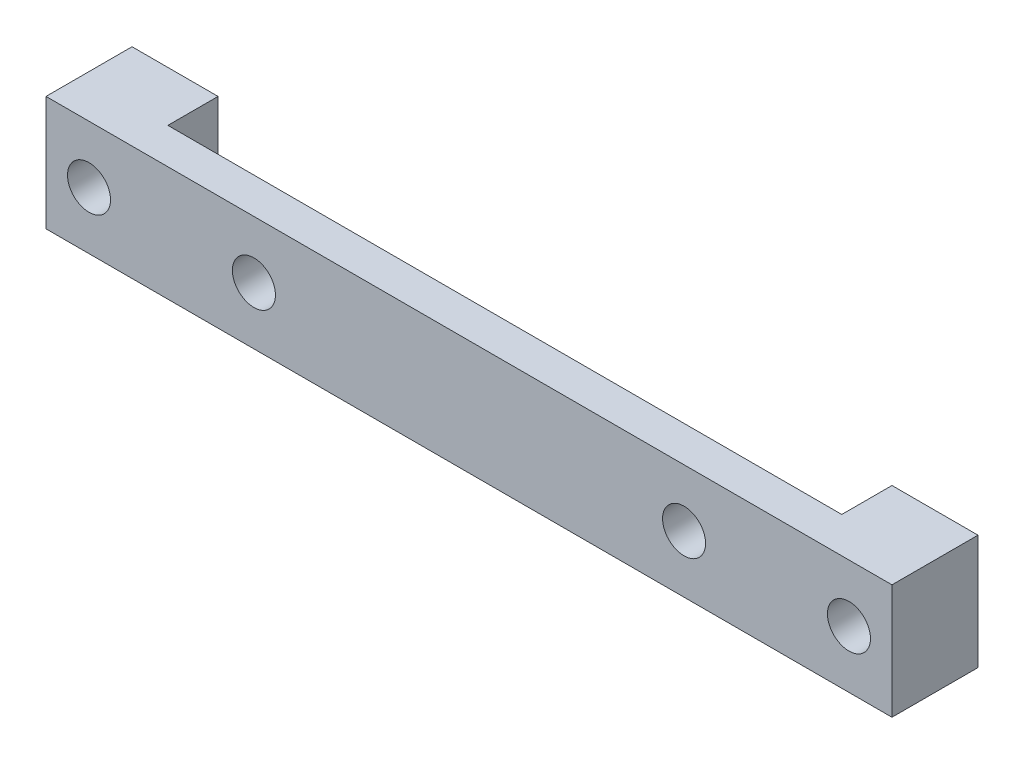
ISO-10303-21;
HEADER;
FILE_DESCRIPTION(('STEP AP214'),'2;1');
FILE_NAME('part.step','',(''),(''),'','','');
FILE_SCHEMA(('AUTOMOTIVE_DESIGN { 1 0 10303 214 1 1 1 1 }'));
ENDSEC;
DATA;
#1=APPLICATION_CONTEXT('core data for automotive mechanical design processes');
#2=APPLICATION_PROTOCOL_DEFINITION('international standard','automotive_design',2000,#1);
#3=PRODUCT_CONTEXT('',#1,'mechanical');
#4=PRODUCT('Part','Part','',(#3));
#5=PRODUCT_RELATED_PRODUCT_CATEGORY('part','',(#4));
#6=PRODUCT_DEFINITION_FORMATION('','',#4);
#7=PRODUCT_DEFINITION_CONTEXT('part definition',#1,'design');
#8=PRODUCT_DEFINITION('design','',#6,#7);
#9=PRODUCT_DEFINITION_SHAPE('','',#8);
#10=(LENGTH_UNIT() NAMED_UNIT(*) SI_UNIT(.MILLI.,.METRE.));
#11=(NAMED_UNIT(*) PLANE_ANGLE_UNIT() SI_UNIT($,.RADIAN.));
#12=(NAMED_UNIT(*) SI_UNIT($,.STERADIAN.) SOLID_ANGLE_UNIT());
#13=UNCERTAINTY_MEASURE_WITH_UNIT(LENGTH_MEASURE(1.E-05),#10,'distance_accuracy_value','');
#14=(GEOMETRIC_REPRESENTATION_CONTEXT(3) GLOBAL_UNCERTAINTY_ASSIGNED_CONTEXT((#13)) GLOBAL_UNIT_ASSIGNED_CONTEXT((#10,
#11,#12)) REPRESENTATION_CONTEXT('',''));
#15=CARTESIAN_POINT('',(0.,0.,0.));
#16=DIRECTION('',(0.,0.,1.));
#17=DIRECTION('',(1.,0.,0.));
#18=AXIS2_PLACEMENT_3D('',#15,#16,#17);
#19=CARTESIAN_POINT('',(29.5,-4.,0.));
#20=DIRECTION('',(0.,0.,1.));
#21=DIRECTION('',(1.,0.,0.));
#22=AXIS2_PLACEMENT_3D('',#19,#20,#21);
#23=PLANE('',#22);
#24=CARTESIAN_POINT('',(26.5,0.,0.));
#25=DIRECTION('',(0.,0.,1.));
#26=DIRECTION('',(1.,0.,0.));
#27=AXIS2_PLACEMENT_3D('',#24,#25,#26);
#28=CIRCLE('',#27,1.5);
#29=CARTESIAN_POINT('',(28.,0.,0.));
#30=VERTEX_POINT('',#29);
#31=EDGE_CURVE('E137',#30,#30,#28,.T.);
#32=ORIENTED_EDGE('',*,*,#31,.T.);
#33=EDGE_LOOP('',(#32));
#34=FACE_BOUND('',#33,.T.);
#35=DIRECTION('',(1.,0.,0.));
#36=VECTOR('',#35,1.);
#37=CARTESIAN_POINT('',(-29.5,-4.,0.));
#38=LINE('',#37,#36);
#39=CARTESIAN_POINT('',(23.5,-4.,0.));
#40=VERTEX_POINT('',#39);
#41=CARTESIAN_POINT('',(29.5,-4.,0.));
#42=VERTEX_POINT('',#41);
#43=EDGE_CURVE('E75',#40,#42,#38,.T.);
#44=ORIENTED_EDGE('',*,*,#43,.F.);
#45=DIRECTION('',(0.,1.,0.));
#46=VECTOR('',#45,1.);
#47=CARTESIAN_POINT('',(23.5,-4.,0.));
#48=LINE('',#47,#46);
#49=CARTESIAN_POINT('',(23.5,4.,0.));
#50=VERTEX_POINT('',#49);
#51=EDGE_CURVE('E134',#40,#50,#48,.T.);
#52=ORIENTED_EDGE('',*,*,#51,.T.);
#53=DIRECTION('',(-1.,0.,0.));
#54=VECTOR('',#53,1.);
#55=CARTESIAN_POINT('',(-29.5,4.,0.));
#56=LINE('',#55,#54);
#57=CARTESIAN_POINT('',(29.5,4.,0.));
#58=VERTEX_POINT('',#57);
#59=EDGE_CURVE('E167',#58,#50,#56,.T.);
#60=ORIENTED_EDGE('',*,*,#59,.F.);
#61=DIRECTION('',(0.,1.,0.));
#62=VECTOR('',#61,1.);
#63=CARTESIAN_POINT('',(29.5,4.,0.));
#64=LINE('',#63,#62);
#65=EDGE_CURVE('E153',#42,#58,#64,.T.);
#66=ORIENTED_EDGE('',*,*,#65,.F.);
#67=EDGE_LOOP('',(#44,#52,#60,#66));
#68=FACE_BOUND('',#67,.T.);
#69=ADVANCED_FACE('F31',(#34,#68),#23,.F.);
#70=CARTESIAN_POINT('',(29.5,-4.,6.));
#71=DIRECTION('',(0.,0.,1.));
#72=DIRECTION('',(1.,0.,0.));
#73=AXIS2_PLACEMENT_3D('',#70,#71,#72);
#74=PLANE('',#73);
#75=CARTESIAN_POINT('',(15.,0.,6.));
#76=DIRECTION('',(0.,0.,1.));
#77=DIRECTION('',(1.,0.,0.));
#78=AXIS2_PLACEMENT_3D('',#75,#76,#77);
#79=CIRCLE('',#78,1.5);
#80=CARTESIAN_POINT('',(16.5,0.,6.));
#81=VERTEX_POINT('',#80);
#82=EDGE_CURVE('E141',#81,#81,#79,.T.);
#83=ORIENTED_EDGE('',*,*,#82,.F.);
#84=EDGE_LOOP('',(#83));
#85=FACE_BOUND('',#84,.T.);
#86=CARTESIAN_POINT('',(-26.5,0.,6.));
#87=DIRECTION('',(0.,0.,1.));
#88=DIRECTION('',(1.,0.,0.));
#89=AXIS2_PLACEMENT_3D('',#86,#87,#88);
#90=CIRCLE('',#89,1.5);
#91=CARTESIAN_POINT('',(-25.,0.,6.));
#92=VERTEX_POINT('',#91);
#93=EDGE_CURVE('E150',#92,#92,#90,.T.);
#94=ORIENTED_EDGE('',*,*,#93,.F.);
#95=EDGE_LOOP('',(#94));
#96=FACE_BOUND('',#95,.T.);
#97=DIRECTION('',(0.,1.,0.));
#98=VECTOR('',#97,1.);
#99=CARTESIAN_POINT('',(29.5,4.,6.));
#100=LINE('',#99,#98);
#101=CARTESIAN_POINT('',(29.5,-4.,6.));
#102=VERTEX_POINT('',#101);
#103=CARTESIAN_POINT('',(29.5,4.,6.));
#104=VERTEX_POINT('',#103);
#105=EDGE_CURVE('E156',#102,#104,#100,.T.);
#106=ORIENTED_EDGE('',*,*,#105,.T.);
#107=DIRECTION('',(-1.,0.,0.));
#108=VECTOR('',#107,1.);
#109=CARTESIAN_POINT('',(-29.5,4.,6.));
#110=LINE('',#109,#108);
#111=CARTESIAN_POINT('',(-29.5,4.,6.));
#112=VERTEX_POINT('',#111);
#113=EDGE_CURVE('E83',#104,#112,#110,.T.);
#114=ORIENTED_EDGE('',*,*,#113,.T.);
#115=DIRECTION('',(0.,-1.,0.));
#116=VECTOR('',#115,1.);
#117=CARTESIAN_POINT('',(-29.5,4.,6.));
#118=LINE('',#117,#116);
#119=CARTESIAN_POINT('',(-29.5,-4.,6.));
#120=VERTEX_POINT('',#119);
#121=EDGE_CURVE('E160',#112,#120,#118,.T.);
#122=ORIENTED_EDGE('',*,*,#121,.T.);
#123=DIRECTION('',(1.,0.,0.));
#124=VECTOR('',#123,1.);
#125=CARTESIAN_POINT('',(-29.5,-4.,6.));
#126=LINE('',#125,#124);
#127=EDGE_CURVE('E55',#120,#102,#126,.T.);
#128=ORIENTED_EDGE('',*,*,#127,.T.);
#129=EDGE_LOOP('',(#106,#114,#122,#128));
#130=FACE_BOUND('',#129,.T.);
#131=CARTESIAN_POINT('',(-15.,0.,6.));
#132=DIRECTION('',(0.,0.,1.));
#133=DIRECTION('',(1.,0.,0.));
#134=AXIS2_PLACEMENT_3D('',#131,#132,#133);
#135=CIRCLE('',#134,1.5);
#136=CARTESIAN_POINT('',(-13.5,0.,6.));
#137=VERTEX_POINT('',#136);
#138=EDGE_CURVE('E146',#137,#137,#135,.T.);
#139=ORIENTED_EDGE('',*,*,#138,.F.);
#140=EDGE_LOOP('',(#139));
#141=FACE_BOUND('',#140,.T.);
#142=CARTESIAN_POINT('',(26.5,0.,6.));
#143=DIRECTION('',(0.,0.,1.));
#144=DIRECTION('',(1.,0.,0.));
#145=AXIS2_PLACEMENT_3D('',#142,#143,#144);
#146=CIRCLE('',#145,1.5);
#147=CARTESIAN_POINT('',(28.,0.,6.));
#148=VERTEX_POINT('',#147);
#149=EDGE_CURVE('E138',#148,#148,#146,.T.);
#150=ORIENTED_EDGE('',*,*,#149,.F.);
#151=EDGE_LOOP('',(#150));
#152=FACE_BOUND('',#151,.T.);
#153=ADVANCED_FACE('F192',(#85,#96,#130,#141,#152),#74,.T.);
#154=CARTESIAN_POINT('',(-26.5,0.,0.));
#155=DIRECTION('',(0.,0.,1.));
#156=DIRECTION('',(1.,0.,0.));
#157=AXIS2_PLACEMENT_3D('',#154,#155,#156);
#158=CIRCLE('',#157,1.5);
#159=CARTESIAN_POINT('',(-25.,0.,0.));
#160=VERTEX_POINT('',#159);
#161=EDGE_CURVE('E149',#160,#160,#158,.T.);
#162=ORIENTED_EDGE('',*,*,#161,.T.);
#163=EDGE_LOOP('',(#162));
#164=FACE_BOUND('',#163,.T.);
#165=CARTESIAN_POINT('',(-23.5,4.,0.));
#166=VERTEX_POINT('',#165);
#167=CARTESIAN_POINT('',(-29.5,4.,0.));
#168=VERTEX_POINT('',#167);
#169=EDGE_CURVE('E166',#166,#168,#56,.T.);
#170=ORIENTED_EDGE('',*,*,#169,.F.);
#171=DIRECTION('',(0.,-1.,0.));
#172=VECTOR('',#171,1.);
#173=CARTESIAN_POINT('',(-23.5,-4.,0.));
#174=LINE('',#173,#172);
#175=CARTESIAN_POINT('',(-23.5,-4.,0.));
#176=VERTEX_POINT('',#175);
#177=EDGE_CURVE('E106',#166,#176,#174,.T.);
#178=ORIENTED_EDGE('',*,*,#177,.T.);
#179=CARTESIAN_POINT('',(-29.5,-4.,0.));
#180=VERTEX_POINT('',#179);
#181=EDGE_CURVE('E158',#180,#176,#38,.T.);
#182=ORIENTED_EDGE('',*,*,#181,.F.);
#183=DIRECTION('',(0.,-1.,0.));
#184=VECTOR('',#183,1.);
#185=CARTESIAN_POINT('',(-29.5,4.,0.));
#186=LINE('',#185,#184);
#187=EDGE_CURVE('E169',#168,#180,#186,.T.);
#188=ORIENTED_EDGE('',*,*,#187,.F.);
#189=EDGE_LOOP('',(#170,#178,#182,#188));
#190=FACE_BOUND('',#189,.T.);
#191=ADVANCED_FACE('F186',(#164,#190),#23,.F.);
#192=CARTESIAN_POINT('',(29.5,4.,6.));
#193=DIRECTION('',(-1.,0.,0.));
#194=DIRECTION('',(0.,-1.,0.));
#195=AXIS2_PLACEMENT_3D('',#192,#193,#194);
#196=PLANE('',#195);
#197=ORIENTED_EDGE('',*,*,#65,.T.);
#198=DIRECTION('',(0.,0.,-1.));
#199=VECTOR('',#198,1.);
#200=CARTESIAN_POINT('',(29.5,4.,6.));
#201=LINE('',#200,#199);
#202=EDGE_CURVE('E180',#104,#58,#201,.T.);
#203=ORIENTED_EDGE('',*,*,#202,.F.);
#204=ORIENTED_EDGE('',*,*,#105,.F.);
#205=DIRECTION('',(0.,0.,-1.));
#206=VECTOR('',#205,1.);
#207=CARTESIAN_POINT('',(29.5,-4.,6.));
#208=LINE('',#207,#206);
#209=EDGE_CURVE('E163',#102,#42,#208,.T.);
#210=ORIENTED_EDGE('',*,*,#209,.T.);
#211=EDGE_LOOP('',(#197,#203,#204,#210));
#212=FACE_BOUND('',#211,.T.);
#213=ADVANCED_FACE('F33',(#212),#196,.F.);
#214=CARTESIAN_POINT('',(-29.5,4.,6.));
#215=DIRECTION('',(0.,-1.,0.));
#216=DIRECTION('',(0.,0.,-1.));
#217=AXIS2_PLACEMENT_3D('',#214,#215,#216);
#218=PLANE('',#217);
#219=ORIENTED_EDGE('',*,*,#59,.T.);
#220=DIRECTION('',(0.,0.,-1.));
#221=VECTOR('',#220,1.);
#222=CARTESIAN_POINT('',(23.5,4.,3.5));
#223=LINE('',#222,#221);
#224=CARTESIAN_POINT('',(23.5,4.,3.5));
#225=VERTEX_POINT('',#224);
#226=EDGE_CURVE('E110',#225,#50,#223,.T.);
#227=ORIENTED_EDGE('',*,*,#226,.F.);
#228=DIRECTION('',(1.,0.,0.));
#229=VECTOR('',#228,1.);
#230=CARTESIAN_POINT('',(-23.5,4.,3.5));
#231=LINE('',#230,#229);
#232=CARTESIAN_POINT('',(-23.5,4.,3.5));
#233=VERTEX_POINT('',#232);
#234=EDGE_CURVE('E109',#233,#225,#231,.T.);
#235=ORIENTED_EDGE('',*,*,#234,.F.);
#236=DIRECTION('',(0.,0.,1.));
#237=VECTOR('',#236,1.);
#238=CARTESIAN_POINT('',(-23.5,4.,3.5));
#239=LINE('',#238,#237);
#240=EDGE_CURVE('E103',#166,#233,#239,.T.);
#241=ORIENTED_EDGE('',*,*,#240,.F.);
#242=ORIENTED_EDGE('',*,*,#169,.T.);
#243=DIRECTION('',(0.,0.,-1.));
#244=VECTOR('',#243,1.);
#245=CARTESIAN_POINT('',(-29.5,4.,6.));
#246=LINE('',#245,#244);
#247=EDGE_CURVE('E177',#112,#168,#246,.T.);
#248=ORIENTED_EDGE('',*,*,#247,.F.);
#249=ORIENTED_EDGE('',*,*,#113,.F.);
#250=ORIENTED_EDGE('',*,*,#202,.T.);
#251=EDGE_LOOP('',(#219,#227,#235,#241,#242,#248,#249,#250));
#252=FACE_BOUND('',#251,.T.);
#253=ADVANCED_FACE('F123',(#252),#218,.F.);
#254=CARTESIAN_POINT('',(-29.5,4.,6.));
#255=DIRECTION('',(1.,0.,0.));
#256=DIRECTION('',(0.,0.,-1.));
#257=AXIS2_PLACEMENT_3D('',#254,#255,#256);
#258=PLANE('',#257);
#259=ORIENTED_EDGE('',*,*,#187,.T.);
#260=DIRECTION('',(0.,0.,-1.));
#261=VECTOR('',#260,1.);
#262=CARTESIAN_POINT('',(-29.5,-4.,6.));
#263=LINE('',#262,#261);
#264=EDGE_CURVE('E174',#120,#180,#263,.T.);
#265=ORIENTED_EDGE('',*,*,#264,.F.);
#266=ORIENTED_EDGE('',*,*,#121,.F.);
#267=ORIENTED_EDGE('',*,*,#247,.T.);
#268=EDGE_LOOP('',(#259,#265,#266,#267));
#269=FACE_BOUND('',#268,.T.);
#270=ADVANCED_FACE('F190',(#269),#258,.F.);
#271=CARTESIAN_POINT('',(-29.5,-4.,6.));
#272=DIRECTION('',(0.,1.,0.));
#273=DIRECTION('',(0.,0.,1.));
#274=AXIS2_PLACEMENT_3D('',#271,#272,#273);
#275=PLANE('',#274);
#276=DIRECTION('',(1.,0.,0.));
#277=VECTOR('',#276,1.);
#278=CARTESIAN_POINT('',(-29.5,-4.,3.5));
#279=LINE('',#278,#277);
#280=CARTESIAN_POINT('',(-23.5,-4.,3.5));
#281=VERTEX_POINT('',#280);
#282=CARTESIAN_POINT('',(23.5,-4.,3.5));
#283=VERTEX_POINT('',#282);
#284=EDGE_CURVE('E118',#281,#283,#279,.T.);
#285=ORIENTED_EDGE('',*,*,#284,.T.);
#286=DIRECTION('',(0.,0.,-1.));
#287=VECTOR('',#286,1.);
#288=CARTESIAN_POINT('',(23.5,-4.,6.));
#289=LINE('',#288,#287);
#290=EDGE_CURVE('E11',#283,#40,#289,.T.);
#291=ORIENTED_EDGE('',*,*,#290,.T.);
#292=ORIENTED_EDGE('',*,*,#43,.T.);
#293=ORIENTED_EDGE('',*,*,#209,.F.);
#294=ORIENTED_EDGE('',*,*,#127,.F.);
#295=ORIENTED_EDGE('',*,*,#264,.T.);
#296=ORIENTED_EDGE('',*,*,#181,.T.);
#297=DIRECTION('',(0.,0.,1.));
#298=VECTOR('',#297,1.);
#299=CARTESIAN_POINT('',(-23.5,-4.,6.));
#300=LINE('',#299,#298);
#301=EDGE_CURVE('E39',#176,#281,#300,.T.);
#302=ORIENTED_EDGE('',*,*,#301,.T.);
#303=EDGE_LOOP('',(#285,#291,#292,#293,#294,#295,#296,#302));
#304=FACE_BOUND('',#303,.T.);
#305=ADVANCED_FACE('F183',(#304),#275,.F.);
#306=CARTESIAN_POINT('',(-26.5,0.,6.));
#307=DIRECTION('',(0.,0.,-1.));
#308=DIRECTION('',(-1.,0.,0.));
#309=AXIS2_PLACEMENT_3D('',#306,#307,#308);
#310=CYLINDRICAL_SURFACE('',#309,1.5);
#311=ORIENTED_EDGE('',*,*,#93,.T.);
#312=EDGE_LOOP('',(#311));
#313=FACE_BOUND('',#312,.T.);
#314=ORIENTED_EDGE('',*,*,#161,.F.);
#315=EDGE_LOOP('',(#314));
#316=FACE_BOUND('',#315,.T.);
#317=ADVANCED_FACE('F228',(#313,#316),#310,.F.);
#318=CARTESIAN_POINT('',(-15.,0.,6.));
#319=DIRECTION('',(0.,0.,-1.));
#320=DIRECTION('',(-1.,0.,0.));
#321=AXIS2_PLACEMENT_3D('',#318,#319,#320);
#322=CYLINDRICAL_SURFACE('',#321,1.5);
#323=CARTESIAN_POINT('',(-15.,0.,3.5));
#324=DIRECTION('',(0.,0.,1.));
#325=DIRECTION('',(1.,0.,0.));
#326=AXIS2_PLACEMENT_3D('',#323,#324,#325);
#327=CIRCLE('',#326,1.5);
#328=CARTESIAN_POINT('',(-13.5,0.,3.5));
#329=VERTEX_POINT('',#328);
#330=EDGE_CURVE('E129',#329,#329,#327,.T.);
#331=ORIENTED_EDGE('',*,*,#330,.F.);
#332=EDGE_LOOP('',(#331));
#333=FACE_BOUND('',#332,.T.);
#334=ORIENTED_EDGE('',*,*,#138,.T.);
#335=EDGE_LOOP('',(#334));
#336=FACE_BOUND('',#335,.T.);
#337=ADVANCED_FACE('F230',(#333,#336),#322,.F.);
#338=CARTESIAN_POINT('',(15.,0.,6.));
#339=DIRECTION('',(0.,0.,-1.));
#340=DIRECTION('',(-1.,0.,0.));
#341=AXIS2_PLACEMENT_3D('',#338,#339,#340);
#342=CYLINDRICAL_SURFACE('',#341,1.5);
#343=CARTESIAN_POINT('',(15.,0.,3.5));
#344=DIRECTION('',(0.,0.,1.));
#345=DIRECTION('',(1.,0.,0.));
#346=AXIS2_PLACEMENT_3D('',#343,#344,#345);
#347=CIRCLE('',#346,1.5);
#348=CARTESIAN_POINT('',(16.5,0.,3.5));
#349=VERTEX_POINT('',#348);
#350=EDGE_CURVE('E127',#349,#349,#347,.T.);
#351=ORIENTED_EDGE('',*,*,#350,.F.);
#352=EDGE_LOOP('',(#351));
#353=FACE_BOUND('',#352,.T.);
#354=ORIENTED_EDGE('',*,*,#82,.T.);
#355=EDGE_LOOP('',(#354));
#356=FACE_BOUND('',#355,.T.);
#357=ADVANCED_FACE('F209',(#353,#356),#342,.F.);
#358=CARTESIAN_POINT('',(26.5,0.,6.));
#359=DIRECTION('',(0.,0.,-1.));
#360=DIRECTION('',(-1.,0.,0.));
#361=AXIS2_PLACEMENT_3D('',#358,#359,#360);
#362=CYLINDRICAL_SURFACE('',#361,1.5);
#363=ORIENTED_EDGE('',*,*,#149,.T.);
#364=EDGE_LOOP('',(#363));
#365=FACE_BOUND('',#364,.T.);
#366=ORIENTED_EDGE('',*,*,#31,.F.);
#367=EDGE_LOOP('',(#366));
#368=FACE_BOUND('',#367,.T.);
#369=ADVANCED_FACE('F202',(#365,#368),#362,.F.);
#370=CARTESIAN_POINT('',(23.5,-11.,3.5));
#371=DIRECTION('',(1.,0.,0.));
#372=DIRECTION('',(0.,0.,-1.));
#373=AXIS2_PLACEMENT_3D('',#370,#371,#372);
#374=PLANE('',#373);
#375=ORIENTED_EDGE('',*,*,#290,.F.);
#376=DIRECTION('',(0.,1.,0.));
#377=VECTOR('',#376,1.);
#378=CARTESIAN_POINT('',(23.5,-11.,3.5));
#379=LINE('',#378,#377);
#380=EDGE_CURVE('E120',#283,#225,#379,.T.);
#381=ORIENTED_EDGE('',*,*,#380,.T.);
#382=ORIENTED_EDGE('',*,*,#226,.T.);
#383=ORIENTED_EDGE('',*,*,#51,.F.);
#384=EDGE_LOOP('',(#375,#381,#382,#383));
#385=FACE_BOUND('',#384,.T.);
#386=ADVANCED_FACE('F200',(#385),#374,.F.);
#387=CARTESIAN_POINT('',(-23.5,-11.,3.5));
#388=DIRECTION('',(-1.,0.,0.));
#389=DIRECTION('',(0.,0.,1.));
#390=AXIS2_PLACEMENT_3D('',#387,#388,#389);
#391=PLANE('',#390);
#392=ORIENTED_EDGE('',*,*,#240,.T.);
#393=DIRECTION('',(0.,1.,0.));
#394=VECTOR('',#393,1.);
#395=CARTESIAN_POINT('',(-23.5,-11.,3.5));
#396=LINE('',#395,#394);
#397=EDGE_CURVE('E46',#281,#233,#396,.T.);
#398=ORIENTED_EDGE('',*,*,#397,.F.);
#399=ORIENTED_EDGE('',*,*,#301,.F.);
#400=ORIENTED_EDGE('',*,*,#177,.F.);
#401=EDGE_LOOP('',(#392,#398,#399,#400));
#402=FACE_BOUND('',#401,.T.);
#403=ADVANCED_FACE('F104',(#402),#391,.F.);
#404=CARTESIAN_POINT('',(-23.5,-11.,3.5));
#405=DIRECTION('',(0.,0.,1.));
#406=DIRECTION('',(1.,0.,0.));
#407=AXIS2_PLACEMENT_3D('',#404,#405,#406);
#408=PLANE('',#407);
#409=ORIENTED_EDGE('',*,*,#350,.T.);
#410=EDGE_LOOP('',(#409));
#411=FACE_BOUND('',#410,.T.);
#412=ORIENTED_EDGE('',*,*,#330,.T.);
#413=EDGE_LOOP('',(#412));
#414=FACE_BOUND('',#413,.T.);
#415=ORIENTED_EDGE('',*,*,#397,.T.);
#416=ORIENTED_EDGE('',*,*,#234,.T.);
#417=ORIENTED_EDGE('',*,*,#380,.F.);
#418=ORIENTED_EDGE('',*,*,#284,.F.);
#419=EDGE_LOOP('',(#415,#416,#417,#418));
#420=FACE_BOUND('',#419,.T.);
#421=ADVANCED_FACE('F114',(#411,#414,#420),#408,.F.);
#422=CLOSED_SHELL('',(#69,#153,#191,#213,#253,#270,#305,#317,#337,#357,#369,#386,#403,#421));
#423=MANIFOLD_SOLID_BREP('B2',#422);
#424=ADVANCED_BREP_SHAPE_REPRESENTATION('',(#18,#423),#14);
#425=SHAPE_DEFINITION_REPRESENTATION(#9,#424);
ENDSEC;
END-ISO-10303-21;
